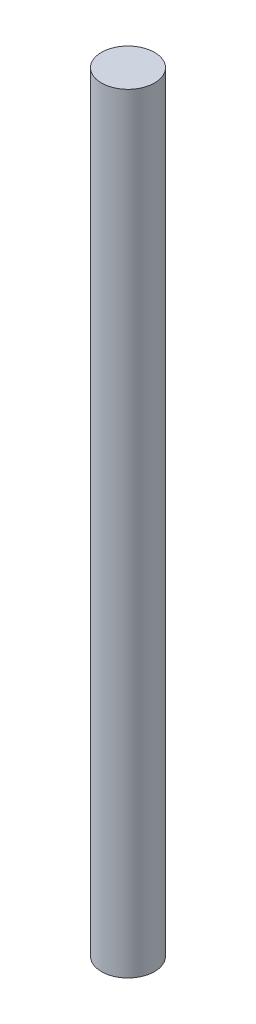
ISO-10303-21;
HEADER;
FILE_DESCRIPTION(('STEP AP214'),'2;1');
FILE_NAME('part.step','',(''),(''),'','','');
FILE_SCHEMA(('AUTOMOTIVE_DESIGN { 1 0 10303 214 1 1 1 1 }'));
ENDSEC;
DATA;
#1=APPLICATION_CONTEXT('core data for automotive mechanical design processes');
#2=APPLICATION_PROTOCOL_DEFINITION('international standard','automotive_design',2000,#1);
#3=PRODUCT_CONTEXT('',#1,'mechanical');
#4=PRODUCT('Part','Part','',(#3));
#5=PRODUCT_RELATED_PRODUCT_CATEGORY('part','',(#4));
#6=PRODUCT_DEFINITION_FORMATION('','',#4);
#7=PRODUCT_DEFINITION_CONTEXT('part definition',#1,'design');
#8=PRODUCT_DEFINITION('design','',#6,#7);
#9=PRODUCT_DEFINITION_SHAPE('','',#8);
#10=(LENGTH_UNIT() NAMED_UNIT(*) SI_UNIT(.MILLI.,.METRE.));
#11=(NAMED_UNIT(*) PLANE_ANGLE_UNIT() SI_UNIT($,.RADIAN.));
#12=(NAMED_UNIT(*) SI_UNIT($,.STERADIAN.) SOLID_ANGLE_UNIT());
#13=UNCERTAINTY_MEASURE_WITH_UNIT(LENGTH_MEASURE(1.E-05),#10,'distance_accuracy_value','');
#14=(GEOMETRIC_REPRESENTATION_CONTEXT(3) GLOBAL_UNCERTAINTY_ASSIGNED_CONTEXT((#13)) GLOBAL_UNIT_ASSIGNED_CONTEXT((#10,
#11,#12)) REPRESENTATION_CONTEXT('',''));
#15=CARTESIAN_POINT('',(0.,0.,0.));
#16=DIRECTION('',(0.,0.,1.));
#17=DIRECTION('',(1.,0.,0.));
#18=AXIS2_PLACEMENT_3D('',#15,#16,#17);
#19=CARTESIAN_POINT('',(0.,43.5,0.));
#20=DIRECTION('',(0.,-1.,0.));
#21=DIRECTION('',(0.,0.,-1.));
#22=AXIS2_PLACEMENT_3D('',#19,#20,#21);
#23=CYLINDRICAL_SURFACE('',#22,1.5);
#24=CARTESIAN_POINT('',(0.,43.5,0.));
#25=DIRECTION('',(0.,1.,0.));
#26=DIRECTION('',(0.,0.,1.));
#27=AXIS2_PLACEMENT_3D('',#24,#25,#26);
#28=CIRCLE('',#27,1.5);
#29=CARTESIAN_POINT('',(0.,43.5,1.5));
#30=VERTEX_POINT('',#29);
#31=EDGE_CURVE('E10',#30,#30,#28,.T.);
#32=ORIENTED_EDGE('',*,*,#31,.F.);
#33=EDGE_LOOP('',(#32));
#34=FACE_BOUND('',#33,.T.);
#35=CARTESIAN_POINT('',(0.,0.,0.));
#36=DIRECTION('',(0.,1.,0.));
#37=DIRECTION('',(0.,0.,1.));
#38=AXIS2_PLACEMENT_3D('',#35,#36,#37);
#39=CIRCLE('',#38,1.5);
#40=CARTESIAN_POINT('',(0.,0.,1.5));
#41=VERTEX_POINT('',#40);
#42=EDGE_CURVE('E34',#41,#41,#39,.T.);
#43=ORIENTED_EDGE('',*,*,#42,.T.);
#44=EDGE_LOOP('',(#43));
#45=FACE_BOUND('',#44,.T.);
#46=ADVANCED_FACE('F31',(#34,#45),#23,.T.);
#47=CARTESIAN_POINT('',(0.,43.5,0.));
#48=DIRECTION('',(0.,1.,0.));
#49=DIRECTION('',(0.,0.,1.));
#50=AXIS2_PLACEMENT_3D('',#47,#48,#49);
#51=PLANE('',#50);
#52=ORIENTED_EDGE('',*,*,#31,.T.);
#53=EDGE_LOOP('',(#52));
#54=FACE_BOUND('',#53,.T.);
#55=ADVANCED_FACE('F46',(#54),#51,.T.);
#56=CARTESIAN_POINT('',(0.,0.,0.));
#57=DIRECTION('',(0.,1.,0.));
#58=DIRECTION('',(0.,0.,1.));
#59=AXIS2_PLACEMENT_3D('',#56,#57,#58);
#60=PLANE('',#59);
#61=ORIENTED_EDGE('',*,*,#42,.F.);
#62=EDGE_LOOP('',(#61));
#63=FACE_BOUND('',#62,.T.);
#64=ADVANCED_FACE('F44',(#63),#60,.F.);
#65=CLOSED_SHELL('',(#46,#55,#64));
#66=MANIFOLD_SOLID_BREP('B2',#65);
#67=ADVANCED_BREP_SHAPE_REPRESENTATION('',(#18,#66),#14);
#68=SHAPE_DEFINITION_REPRESENTATION(#9,#67);
ENDSEC;
END-ISO-10303-21;
